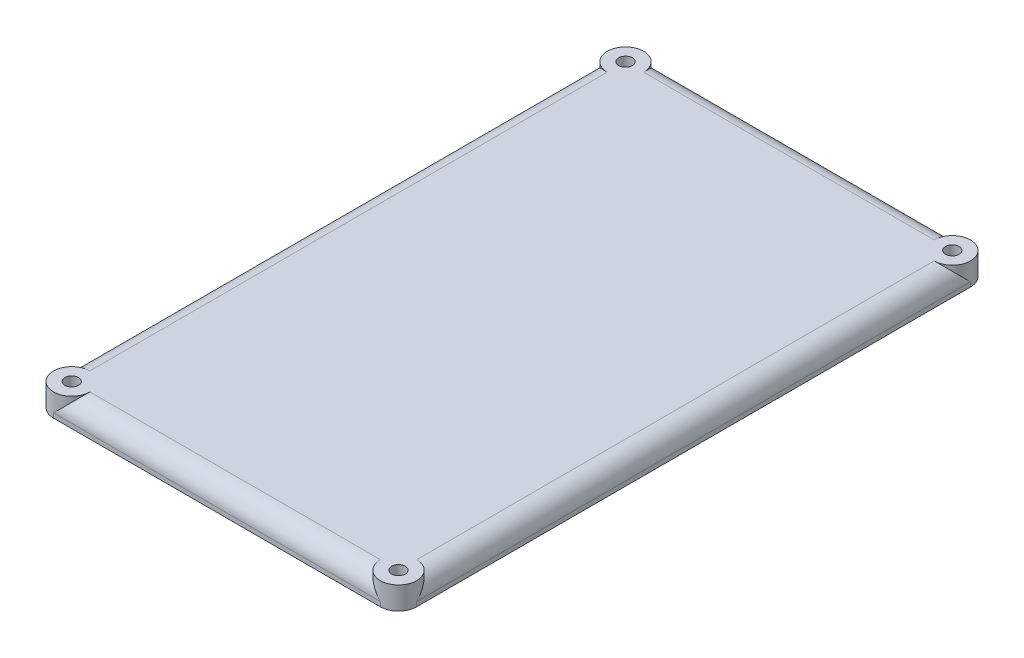
ISO-10303-21;
HEADER;
FILE_DESCRIPTION(('STEP AP214'),'2;1');
FILE_NAME('part.step','',(''),(''),'','','');
FILE_SCHEMA(('AUTOMOTIVE_DESIGN { 1 0 10303 214 1 1 1 1 }'));
ENDSEC;
DATA;
#1=APPLICATION_CONTEXT('core data for automotive mechanical design processes');
#2=APPLICATION_PROTOCOL_DEFINITION('international standard','automotive_design',2000,#1);
#3=PRODUCT_CONTEXT('',#1,'mechanical');
#4=PRODUCT('Part','Part','',(#3));
#5=PRODUCT_RELATED_PRODUCT_CATEGORY('part','',(#4));
#6=PRODUCT_DEFINITION_FORMATION('','',#4);
#7=PRODUCT_DEFINITION_CONTEXT('part definition',#1,'design');
#8=PRODUCT_DEFINITION('design','',#6,#7);
#9=PRODUCT_DEFINITION_SHAPE('','',#8);
#10=(LENGTH_UNIT() NAMED_UNIT(*) SI_UNIT(.MILLI.,.METRE.));
#11=(NAMED_UNIT(*) PLANE_ANGLE_UNIT() SI_UNIT($,.RADIAN.));
#12=(NAMED_UNIT(*) SI_UNIT($,.STERADIAN.) SOLID_ANGLE_UNIT());
#13=UNCERTAINTY_MEASURE_WITH_UNIT(LENGTH_MEASURE(1.E-05),#10,'distance_accuracy_value','');
#14=(GEOMETRIC_REPRESENTATION_CONTEXT(3) GLOBAL_UNCERTAINTY_ASSIGNED_CONTEXT((#13)) GLOBAL_UNIT_ASSIGNED_CONTEXT((#10,
#11,#12)) REPRESENTATION_CONTEXT('',''));
#15=CARTESIAN_POINT('',(0.,0.,0.));
#16=DIRECTION('',(0.,0.,1.));
#17=DIRECTION('',(1.,0.,0.));
#18=AXIS2_PLACEMENT_3D('',#15,#16,#17);
#19=CARTESIAN_POINT('',(0.,3.175,0.));
#20=DIRECTION('',(1.,0.,0.));
#21=DIRECTION('',(0.,0.,-1.));
#22=AXIS2_PLACEMENT_3D('',#19,#20,#21);
#23=PLANE('',#22);
#24=DIRECTION('',(0.,0.,1.));
#25=VECTOR('',#24,1.);
#26=CARTESIAN_POINT('',(0.,0.635,0.));
#27=LINE('',#26,#25);
#28=CARTESIAN_POINT('',(0.,0.635,80.01));
#29=VERTEX_POINT('',#28);
#30=CARTESIAN_POINT('',(0.,0.635,2.54));
#31=VERTEX_POINT('',#30);
#32=EDGE_CURVE('E188',#29,#31,#27,.F.);
#33=ORIENTED_EDGE('',*,*,#32,.T.);
#34=DIRECTION('',(0.,-1.,0.));
#35=VECTOR('',#34,1.);
#36=CARTESIAN_POINT('',(0.,3.175,2.54));
#37=LINE('',#36,#35);
#38=CARTESIAN_POINT('',(0.,0.,2.54));
#39=VERTEX_POINT('',#38);
#40=EDGE_CURVE('E192',#31,#39,#37,.T.);
#41=ORIENTED_EDGE('',*,*,#40,.T.);
#42=DIRECTION('',(0.,0.,1.));
#43=VECTOR('',#42,1.);
#44=CARTESIAN_POINT('',(0.,0.,0.));
#45=LINE('',#44,#43);
#46=CARTESIAN_POINT('',(0.,0.,80.01));
#47=VERTEX_POINT('',#46);
#48=EDGE_CURVE('E180',#39,#47,#45,.T.);
#49=ORIENTED_EDGE('',*,*,#48,.T.);
#50=DIRECTION('',(0.,-1.,0.));
#51=VECTOR('',#50,1.);
#52=CARTESIAN_POINT('',(0.,3.175,80.01));
#53=LINE('',#52,#51);
#54=EDGE_CURVE('E190',#47,#29,#53,.F.);
#55=ORIENTED_EDGE('',*,*,#54,.T.);
#56=EDGE_LOOP('',(#33,#41,#49,#55));
#57=FACE_BOUND('',#56,.T.);
#58=ADVANCED_FACE('F33',(#57),#23,.F.);
#59=CARTESIAN_POINT('',(0.,3.175,82.55));
#60=DIRECTION('',(0.,0.,-1.));
#61=DIRECTION('',(-1.,0.,0.));
#62=AXIS2_PLACEMENT_3D('',#59,#60,#61);
#63=PLANE('',#62);
#64=DIRECTION('',(1.,0.,0.));
#65=VECTOR('',#64,1.);
#66=CARTESIAN_POINT('',(0.,0.,82.55));
#67=LINE('',#66,#65);
#68=CARTESIAN_POINT('',(2.54000000000001,0.,82.55));
#69=VERTEX_POINT('',#68);
#70=CARTESIAN_POINT('',(48.26,0.,82.55));
#71=VERTEX_POINT('',#70);
#72=EDGE_CURVE('E182',#69,#71,#67,.T.);
#73=ORIENTED_EDGE('',*,*,#72,.T.);
#74=DIRECTION('',(0.,-1.,0.));
#75=VECTOR('',#74,1.);
#76=CARTESIAN_POINT('',(48.26,3.175,82.55));
#77=LINE('',#76,#75);
#78=CARTESIAN_POINT('',(48.26,0.635,82.55));
#79=VERTEX_POINT('',#78);
#80=EDGE_CURVE('E214',#71,#79,#77,.F.);
#81=ORIENTED_EDGE('',*,*,#80,.T.);
#82=DIRECTION('',(1.,0.,0.));
#83=VECTOR('',#82,1.);
#84=CARTESIAN_POINT('',(0.,0.635,82.55));
#85=LINE('',#84,#83);
#86=CARTESIAN_POINT('',(2.54000000000001,0.635,82.55));
#87=VERTEX_POINT('',#86);
#88=EDGE_CURVE('E209',#79,#87,#85,.F.);
#89=ORIENTED_EDGE('',*,*,#88,.T.);
#90=DIRECTION('',(0.,-1.,0.));
#91=VECTOR('',#90,1.);
#92=CARTESIAN_POINT('',(2.54000000000001,3.175,82.55));
#93=LINE('',#92,#91);
#94=EDGE_CURVE('E212',#87,#69,#93,.T.);
#95=ORIENTED_EDGE('',*,*,#94,.T.);
#96=EDGE_LOOP('',(#73,#81,#89,#95));
#97=FACE_BOUND('',#96,.T.);
#98=ADVANCED_FACE('F241',(#97),#63,.F.);
#99=CARTESIAN_POINT('',(50.8,3.175,0.));
#100=DIRECTION('',(-1.,0.,0.));
#101=DIRECTION('',(0.,0.,1.));
#102=AXIS2_PLACEMENT_3D('',#99,#100,#101);
#103=PLANE('',#102);
#104=DIRECTION('',(0.,0.,-1.));
#105=VECTOR('',#104,1.);
#106=CARTESIAN_POINT('',(50.8,0.,0.));
#107=LINE('',#106,#105);
#108=CARTESIAN_POINT('',(50.8,0.,80.01));
#109=VERTEX_POINT('',#108);
#110=CARTESIAN_POINT('',(50.8,0.,2.54));
#111=VERTEX_POINT('',#110);
#112=EDGE_CURVE('E184',#109,#111,#107,.T.);
#113=ORIENTED_EDGE('',*,*,#112,.T.);
#114=DIRECTION('',(0.,-1.,0.));
#115=VECTOR('',#114,1.);
#116=CARTESIAN_POINT('',(50.8,3.175,2.54));
#117=LINE('',#116,#115);
#118=CARTESIAN_POINT('',(50.8,0.635,2.54));
#119=VERTEX_POINT('',#118);
#120=EDGE_CURVE('E203',#111,#119,#117,.F.);
#121=ORIENTED_EDGE('',*,*,#120,.T.);
#122=DIRECTION('',(0.,0.,-1.));
#123=VECTOR('',#122,1.);
#124=CARTESIAN_POINT('',(50.8,0.635,82.55));
#125=LINE('',#124,#123);
#126=CARTESIAN_POINT('',(50.8,0.635,80.01));
#127=VERTEX_POINT('',#126);
#128=EDGE_CURVE('E139',#119,#127,#125,.F.);
#129=ORIENTED_EDGE('',*,*,#128,.T.);
#130=DIRECTION('',(0.,-1.,0.));
#131=VECTOR('',#130,1.);
#132=CARTESIAN_POINT('',(50.8,3.175,80.01));
#133=LINE('',#132,#131);
#134=EDGE_CURVE('E200',#127,#109,#133,.T.);
#135=ORIENTED_EDGE('',*,*,#134,.T.);
#136=EDGE_LOOP('',(#113,#121,#129,#135));
#137=FACE_BOUND('',#136,.T.);
#138=ADVANCED_FACE('F251',(#137),#103,.F.);
#139=CARTESIAN_POINT('',(0.,3.175,0.));
#140=DIRECTION('',(0.,0.,1.));
#141=DIRECTION('',(1.,0.,0.));
#142=AXIS2_PLACEMENT_3D('',#139,#140,#141);
#143=PLANE('',#142);
#144=DIRECTION('',(-1.,0.,0.));
#145=VECTOR('',#144,1.);
#146=CARTESIAN_POINT('',(0.,0.,0.));
#147=LINE('',#146,#145);
#148=CARTESIAN_POINT('',(48.26,0.,0.));
#149=VERTEX_POINT('',#148);
#150=CARTESIAN_POINT('',(2.54,0.,0.));
#151=VERTEX_POINT('',#150);
#152=EDGE_CURVE('E186',#149,#151,#147,.T.);
#153=ORIENTED_EDGE('',*,*,#152,.T.);
#154=DIRECTION('',(0.,-1.,0.));
#155=VECTOR('',#154,1.);
#156=CARTESIAN_POINT('',(2.54,3.175,0.));
#157=LINE('',#156,#155);
#158=CARTESIAN_POINT('',(2.54,0.635,0.));
#159=VERTEX_POINT('',#158);
#160=EDGE_CURVE('E198',#151,#159,#157,.F.);
#161=ORIENTED_EDGE('',*,*,#160,.T.);
#162=DIRECTION('',(-1.,0.,0.));
#163=VECTOR('',#162,1.);
#164=CARTESIAN_POINT('',(50.8,0.635,0.));
#165=LINE('',#164,#163);
#166=CARTESIAN_POINT('',(48.26,0.635,0.));
#167=VERTEX_POINT('',#166);
#168=EDGE_CURVE('E194',#159,#167,#165,.F.);
#169=ORIENTED_EDGE('',*,*,#168,.T.);
#170=DIRECTION('',(0.,-1.,0.));
#171=VECTOR('',#170,1.);
#172=CARTESIAN_POINT('',(48.26,3.175,0.));
#173=LINE('',#172,#171);
#174=EDGE_CURVE('E196',#167,#149,#173,.T.);
#175=ORIENTED_EDGE('',*,*,#174,.T.);
#176=EDGE_LOOP('',(#153,#161,#169,#175));
#177=FACE_BOUND('',#176,.T.);
#178=ADVANCED_FACE('F254',(#177),#143,.F.);
#179=CARTESIAN_POINT('',(0.,3.175,0.));
#180=DIRECTION('',(0.,1.,0.));
#181=DIRECTION('',(0.,0.,1.));
#182=AXIS2_PLACEMENT_3D('',#179,#180,#181);
#183=PLANE('',#182);
#184=CARTESIAN_POINT('',(48.26,3.175,2.54));
#185=DIRECTION('',(0.,1.,0.));
#186=DIRECTION('',(0.,0.,1.));
#187=AXIS2_PLACEMENT_3D('',#184,#185,#186);
#188=CIRCLE('',#187,0.952500000000004);
#189=CARTESIAN_POINT('',(48.26,3.175,3.4925));
#190=VERTEX_POINT('',#189);
#191=EDGE_CURVE('E321',#190,#190,#188,.T.);
#192=ORIENTED_EDGE('',*,*,#191,.F.);
#193=EDGE_LOOP('',(#192));
#194=FACE_BOUND('',#193,.T.);
#195=CARTESIAN_POINT('',(2.54000000000001,3.175,80.01));
#196=DIRECTION('',(0.,1.,0.));
#197=DIRECTION('',(0.,0.,1.));
#198=AXIS2_PLACEMENT_3D('',#195,#196,#197);
#199=CIRCLE('',#198,0.952499999999999);
#200=CARTESIAN_POINT('',(2.54000000000001,3.175,80.9625));
#201=VERTEX_POINT('',#200);
#202=EDGE_CURVE('E315',#201,#201,#199,.T.);
#203=ORIENTED_EDGE('',*,*,#202,.F.);
#204=EDGE_LOOP('',(#203));
#205=FACE_BOUND('',#204,.T.);
#206=CARTESIAN_POINT('',(48.26,3.175,80.01));
#207=DIRECTION('',(0.,1.,0.));
#208=DIRECTION('',(0.,0.,1.));
#209=AXIS2_PLACEMENT_3D('',#206,#207,#208);
#210=CIRCLE('',#209,0.952500000000002);
#211=CARTESIAN_POINT('',(48.26,3.175,80.9625));
#212=VERTEX_POINT('',#211);
#213=EDGE_CURVE('E312',#212,#212,#210,.T.);
#214=ORIENTED_EDGE('',*,*,#213,.F.);
#215=EDGE_LOOP('',(#214));
#216=FACE_BOUND('',#215,.T.);
#217=CARTESIAN_POINT('',(2.54,3.175,2.54));
#218=DIRECTION('',(0.,1.,0.));
#219=DIRECTION('',(0.,0.,1.));
#220=AXIS2_PLACEMENT_3D('',#217,#218,#219);
#221=CIRCLE('',#220,0.9525);
#222=CARTESIAN_POINT('',(2.54,3.175,3.4925));
#223=VERTEX_POINT('',#222);
#224=EDGE_CURVE('E154',#223,#223,#221,.T.);
#225=ORIENTED_EDGE('',*,*,#224,.F.);
#226=EDGE_LOOP('',(#225));
#227=FACE_BOUND('',#226,.T.);
#228=DIRECTION('',(0.,0.,-1.));
#229=VECTOR('',#228,1.);
#230=CARTESIAN_POINT('',(48.26,3.175,0.));
#231=LINE('',#230,#229);
#232=CARTESIAN_POINT('',(48.26,3.175,77.47));
#233=VERTEX_POINT('',#232);
#234=CARTESIAN_POINT('',(48.26,3.175,5.08));
#235=VERTEX_POINT('',#234);
#236=EDGE_CURVE('E123',#233,#235,#231,.T.);
#237=ORIENTED_EDGE('',*,*,#236,.T.);
#238=CARTESIAN_POINT('',(48.26,3.175,2.54));
#239=DIRECTION('',(0.,1.,0.));
#240=DIRECTION('',(0.,0.,1.));
#241=AXIS2_PLACEMENT_3D('',#238,#239,#240);
#242=CIRCLE('',#241,2.54);
#243=CARTESIAN_POINT('',(45.72,3.175,2.54));
#244=VERTEX_POINT('',#243);
#245=EDGE_CURVE('E127',#235,#244,#242,.T.);
#246=ORIENTED_EDGE('',*,*,#245,.T.);
#247=DIRECTION('',(-1.,0.,0.));
#248=VECTOR('',#247,1.);
#249=CARTESIAN_POINT('',(0.,3.175,2.54));
#250=LINE('',#249,#248);
#251=CARTESIAN_POINT('',(5.08,3.175,2.54));
#252=VERTEX_POINT('',#251);
#253=EDGE_CURVE('E132',#244,#252,#250,.T.);
#254=ORIENTED_EDGE('',*,*,#253,.T.);
#255=CARTESIAN_POINT('',(2.54,3.175,2.54));
#256=DIRECTION('',(0.,1.,0.));
#257=DIRECTION('',(0.,0.,1.));
#258=AXIS2_PLACEMENT_3D('',#255,#256,#257);
#259=CIRCLE('',#258,2.54);
#260=CARTESIAN_POINT('',(2.54,3.175,5.08));
#261=VERTEX_POINT('',#260);
#262=EDGE_CURVE('E151',#252,#261,#259,.T.);
#263=ORIENTED_EDGE('',*,*,#262,.T.);
#264=DIRECTION('',(0.,0.,1.));
#265=VECTOR('',#264,1.);
#266=CARTESIAN_POINT('',(2.54000000000001,3.175,82.55));
#267=LINE('',#266,#265);
#268=CARTESIAN_POINT('',(2.54000000000001,3.175,77.47));
#269=VERTEX_POINT('',#268);
#270=EDGE_CURVE('E133',#261,#269,#267,.T.);
#271=ORIENTED_EDGE('',*,*,#270,.T.);
#272=CARTESIAN_POINT('',(2.54000000000001,3.175,80.01));
#273=DIRECTION('',(0.,1.,0.));
#274=DIRECTION('',(0.,0.,1.));
#275=AXIS2_PLACEMENT_3D('',#272,#273,#274);
#276=CIRCLE('',#275,2.54);
#277=CARTESIAN_POINT('',(5.08000000000001,3.175,80.01));
#278=VERTEX_POINT('',#277);
#279=EDGE_CURVE('E161',#269,#278,#276,.T.);
#280=ORIENTED_EDGE('',*,*,#279,.T.);
#281=DIRECTION('',(1.,0.,0.));
#282=VECTOR('',#281,1.);
#283=CARTESIAN_POINT('',(50.8,3.175,80.01));
#284=LINE('',#283,#282);
#285=CARTESIAN_POINT('',(45.72,3.175,80.01));
#286=VERTEX_POINT('',#285);
#287=EDGE_CURVE('E205',#278,#286,#284,.T.);
#288=ORIENTED_EDGE('',*,*,#287,.T.);
#289=CARTESIAN_POINT('',(48.26,3.175,80.01));
#290=DIRECTION('',(0.,1.,0.));
#291=DIRECTION('',(0.,0.,1.));
#292=AXIS2_PLACEMENT_3D('',#289,#290,#291);
#293=CIRCLE('',#292,2.54);
#294=EDGE_CURVE('E129',#286,#233,#293,.T.);
#295=ORIENTED_EDGE('',*,*,#294,.T.);
#296=EDGE_LOOP('',(#237,#246,#254,#263,#271,#280,#288,#295));
#297=FACE_BOUND('',#296,.T.);
#298=ADVANCED_FACE('F125',(#194,#205,#216,#227,#297),#183,.T.);
#299=CARTESIAN_POINT('',(0.,0.,0.));
#300=DIRECTION('',(0.,1.,0.));
#301=DIRECTION('',(0.,0.,1.));
#302=AXIS2_PLACEMENT_3D('',#299,#300,#301);
#303=PLANE('',#302);
#304=CARTESIAN_POINT('',(48.26,0.,2.54));
#305=DIRECTION('',(0.,1.,0.));
#306=DIRECTION('',(0.,0.,1.));
#307=AXIS2_PLACEMENT_3D('',#304,#305,#306);
#308=CIRCLE('',#307,0.952500000000004);
#309=CARTESIAN_POINT('',(48.26,0.,3.4925));
#310=VERTEX_POINT('',#309);
#311=EDGE_CURVE('E318',#310,#310,#308,.T.);
#312=ORIENTED_EDGE('',*,*,#311,.T.);
#313=EDGE_LOOP('',(#312));
#314=FACE_BOUND('',#313,.T.);
#315=CARTESIAN_POINT('',(2.54000000000001,0.,80.01));
#316=DIRECTION('',(0.,1.,0.));
#317=DIRECTION('',(0.,0.,1.));
#318=AXIS2_PLACEMENT_3D('',#315,#316,#317);
#319=CIRCLE('',#318,0.952499999999999);
#320=CARTESIAN_POINT('',(2.54000000000001,0.,80.9625));
#321=VERTEX_POINT('',#320);
#322=EDGE_CURVE('E324',#321,#321,#319,.T.);
#323=ORIENTED_EDGE('',*,*,#322,.T.);
#324=EDGE_LOOP('',(#323));
#325=FACE_BOUND('',#324,.T.);
#326=CARTESIAN_POINT('',(48.26,0.,80.01));
#327=DIRECTION('',(0.,1.,0.));
#328=DIRECTION('',(0.,0.,1.));
#329=AXIS2_PLACEMENT_3D('',#326,#327,#328);
#330=CIRCLE('',#329,0.952500000000002);
#331=CARTESIAN_POINT('',(48.26,0.,80.9625));
#332=VERTEX_POINT('',#331);
#333=EDGE_CURVE('E309',#332,#332,#330,.T.);
#334=ORIENTED_EDGE('',*,*,#333,.T.);
#335=EDGE_LOOP('',(#334));
#336=FACE_BOUND('',#335,.T.);
#337=CARTESIAN_POINT('',(2.54,0.,2.54));
#338=DIRECTION('',(0.,1.,0.));
#339=DIRECTION('',(0.,0.,1.));
#340=AXIS2_PLACEMENT_3D('',#337,#338,#339);
#341=CIRCLE('',#340,0.9525);
#342=CARTESIAN_POINT('',(2.54,0.,3.4925));
#343=VERTEX_POINT('',#342);
#344=EDGE_CURVE('E148',#343,#343,#341,.T.);
#345=ORIENTED_EDGE('',*,*,#344,.T.);
#346=EDGE_LOOP('',(#345));
#347=FACE_BOUND('',#346,.T.);
#348=ORIENTED_EDGE('',*,*,#152,.F.);
#349=CARTESIAN_POINT('',(48.26,0.,2.54));
#350=DIRECTION('',(0.,1.,0.));
#351=DIRECTION('',(0.,0.,1.));
#352=AXIS2_PLACEMENT_3D('',#349,#350,#351);
#353=CIRCLE('',#352,2.54);
#354=EDGE_CURVE('E147',#111,#149,#353,.T.);
#355=ORIENTED_EDGE('',*,*,#354,.F.);
#356=ORIENTED_EDGE('',*,*,#112,.F.);
#357=CARTESIAN_POINT('',(48.26,0.,80.01));
#358=DIRECTION('',(0.,1.,0.));
#359=DIRECTION('',(0.,0.,1.));
#360=AXIS2_PLACEMENT_3D('',#357,#358,#359);
#361=CIRCLE('',#360,2.54);
#362=EDGE_CURVE('E169',#71,#109,#361,.T.);
#363=ORIENTED_EDGE('',*,*,#362,.F.);
#364=ORIENTED_EDGE('',*,*,#72,.F.);
#365=CARTESIAN_POINT('',(2.54000000000001,0.,80.01));
#366=DIRECTION('',(0.,1.,0.));
#367=DIRECTION('',(0.,0.,1.));
#368=AXIS2_PLACEMENT_3D('',#365,#366,#367);
#369=CIRCLE('',#368,2.54);
#370=EDGE_CURVE('E164',#47,#69,#369,.T.);
#371=ORIENTED_EDGE('',*,*,#370,.F.);
#372=ORIENTED_EDGE('',*,*,#48,.F.);
#373=CARTESIAN_POINT('',(2.54,0.,2.54));
#374=DIRECTION('',(0.,1.,0.));
#375=DIRECTION('',(0.,0.,1.));
#376=AXIS2_PLACEMENT_3D('',#373,#374,#375);
#377=CIRCLE('',#376,2.54);
#378=EDGE_CURVE('E158',#151,#39,#377,.T.);
#379=ORIENTED_EDGE('',*,*,#378,.F.);
#380=EDGE_LOOP('',(#348,#355,#356,#363,#364,#371,#372,#379));
#381=FACE_BOUND('',#380,.T.);
#382=ADVANCED_FACE('F235',(#314,#325,#336,#347,#381),#303,.F.);
#383=CARTESIAN_POINT('',(48.26,0.635,0.));
#384=DIRECTION('',(0.,0.,1.));
#385=DIRECTION('',(1.,0.,0.));
#386=AXIS2_PLACEMENT_3D('',#383,#384,#385);
#387=CYLINDRICAL_SURFACE('',#386,2.54);
#388=CARTESIAN_POINT('',(48.26,0.635,2.54));
#389=DIRECTION('',(0.,-0.707106781186547,0.707106781186547));
#390=DIRECTION('',(0.,0.707106781186547,0.707106781186547));
#391=AXIS2_PLACEMENT_3D('',#388,#389,#390);
#392=ELLIPSE('',#391,3.59210244842766,2.54);
#393=EDGE_CURVE('E137',#235,#119,#392,.F.);
#394=ORIENTED_EDGE('',*,*,#393,.F.);
#395=ORIENTED_EDGE('',*,*,#236,.F.);
#396=CARTESIAN_POINT('',(48.26,0.635,80.01));
#397=DIRECTION('',(0.,0.707106781186547,0.707106781186547));
#398=DIRECTION('',(0.,-0.707106781186547,0.707106781186547));
#399=AXIS2_PLACEMENT_3D('',#396,#397,#398);
#400=ELLIPSE('',#399,3.59210244842766,2.54);
#401=EDGE_CURVE('E142',#127,#233,#400,.T.);
#402=ORIENTED_EDGE('',*,*,#401,.F.);
#403=ORIENTED_EDGE('',*,*,#128,.F.);
#404=EDGE_LOOP('',(#394,#395,#402,#403));
#405=FACE_BOUND('',#404,.T.);
#406=ADVANCED_FACE('F35',(#405),#387,.T.);
#407=CARTESIAN_POINT('',(0.,0.635,80.01));
#408=DIRECTION('',(-1.,0.,0.));
#409=DIRECTION('',(0.,0.,1.));
#410=AXIS2_PLACEMENT_3D('',#407,#408,#409);
#411=CYLINDRICAL_SURFACE('',#410,2.54);
#412=CARTESIAN_POINT('',(2.54000000000001,0.635,80.01));
#413=DIRECTION('',(-0.707106781186547,0.707106781186547,0.));
#414=DIRECTION('',(-0.707106781186547,-0.707106781186547,0.));
#415=AXIS2_PLACEMENT_3D('',#412,#413,#414);
#416=ELLIPSE('',#415,3.59210244842766,2.54);
#417=EDGE_CURVE('E143',#87,#278,#416,.T.);
#418=ORIENTED_EDGE('',*,*,#417,.F.);
#419=ORIENTED_EDGE('',*,*,#88,.F.);
#420=CARTESIAN_POINT('',(48.26,0.635,80.01));
#421=DIRECTION('',(-0.707106781186547,-0.707106781186547,0.));
#422=DIRECTION('',(-0.707106781186547,0.707106781186547,0.));
#423=AXIS2_PLACEMENT_3D('',#420,#421,#422);
#424=ELLIPSE('',#423,3.59210244842766,2.54);
#425=EDGE_CURVE('E11',#286,#79,#424,.F.);
#426=ORIENTED_EDGE('',*,*,#425,.F.);
#427=ORIENTED_EDGE('',*,*,#287,.F.);
#428=EDGE_LOOP('',(#418,#419,#426,#427));
#429=FACE_BOUND('',#428,.T.);
#430=ADVANCED_FACE('F246',(#429),#411,.T.);
#431=CARTESIAN_POINT('',(0.,0.635,2.54));
#432=DIRECTION('',(1.,0.,0.));
#433=DIRECTION('',(0.,0.,-1.));
#434=AXIS2_PLACEMENT_3D('',#431,#432,#433);
#435=CYLINDRICAL_SURFACE('',#434,2.54);
#436=CARTESIAN_POINT('',(48.26,0.635,2.54));
#437=DIRECTION('',(0.707106781186547,0.707106781186547,0.));
#438=DIRECTION('',(0.707106781186547,-0.707106781186547,0.));
#439=AXIS2_PLACEMENT_3D('',#436,#437,#438);
#440=ELLIPSE('',#439,3.59210244842766,2.54);
#441=EDGE_CURVE('E41',#167,#244,#440,.T.);
#442=ORIENTED_EDGE('',*,*,#441,.F.);
#443=ORIENTED_EDGE('',*,*,#168,.F.);
#444=CARTESIAN_POINT('',(2.54,0.635,2.54));
#445=DIRECTION('',(0.707106781186547,-0.707106781186547,0.));
#446=DIRECTION('',(0.707106781186547,0.707106781186547,0.));
#447=AXIS2_PLACEMENT_3D('',#444,#445,#446);
#448=ELLIPSE('',#447,3.59210244842766,2.54);
#449=EDGE_CURVE('E174',#252,#159,#448,.F.);
#450=ORIENTED_EDGE('',*,*,#449,.F.);
#451=ORIENTED_EDGE('',*,*,#253,.F.);
#452=EDGE_LOOP('',(#442,#443,#450,#451));
#453=FACE_BOUND('',#452,.T.);
#454=ADVANCED_FACE('F256',(#453),#435,.T.);
#455=CARTESIAN_POINT('',(2.54,0.635,0.));
#456=DIRECTION('',(0.,0.,-1.));
#457=DIRECTION('',(-1.,0.,0.));
#458=AXIS2_PLACEMENT_3D('',#455,#456,#457);
#459=CYLINDRICAL_SURFACE('',#458,2.54);
#460=CARTESIAN_POINT('',(2.54,0.635,2.54));
#461=DIRECTION('',(0.,0.707106781186547,-0.707106781186547));
#462=DIRECTION('',(0.,-0.707106781186547,-0.707106781186547));
#463=AXIS2_PLACEMENT_3D('',#460,#461,#462);
#464=ELLIPSE('',#463,3.59210244842766,2.54);
#465=EDGE_CURVE('E55',#31,#261,#464,.T.);
#466=ORIENTED_EDGE('',*,*,#465,.F.);
#467=ORIENTED_EDGE('',*,*,#32,.F.);
#468=CARTESIAN_POINT('',(2.54000000000001,0.635,80.01));
#469=DIRECTION('',(0.,-0.707106781186547,-0.707106781186547));
#470=DIRECTION('',(0.,0.707106781186547,-0.707106781186547));
#471=AXIS2_PLACEMENT_3D('',#468,#469,#470);
#472=ELLIPSE('',#471,3.59210244842766,2.54);
#473=EDGE_CURVE('E216',#269,#29,#472,.F.);
#474=ORIENTED_EDGE('',*,*,#473,.F.);
#475=ORIENTED_EDGE('',*,*,#270,.F.);
#476=EDGE_LOOP('',(#466,#467,#474,#475));
#477=FACE_BOUND('',#476,.T.);
#478=ADVANCED_FACE('F224',(#477),#459,.T.);
#479=CARTESIAN_POINT('',(48.26,0.,80.01));
#480=DIRECTION('',(0.,1.,0.));
#481=DIRECTION('',(0.,0.,1.));
#482=AXIS2_PLACEMENT_3D('',#479,#480,#481);
#483=CYLINDRICAL_SURFACE('',#482,2.54);
#484=ORIENTED_EDGE('',*,*,#362,.T.);
#485=ORIENTED_EDGE('',*,*,#134,.F.);
#486=ORIENTED_EDGE('',*,*,#401,.T.);
#487=ORIENTED_EDGE('',*,*,#294,.F.);
#488=ORIENTED_EDGE('',*,*,#425,.T.);
#489=ORIENTED_EDGE('',*,*,#80,.F.);
#490=EDGE_LOOP('',(#484,#485,#486,#487,#488,#489));
#491=FACE_BOUND('',#490,.T.);
#492=ADVANCED_FACE('F248',(#491),#483,.T.);
#493=CARTESIAN_POINT('',(2.54000000000001,0.,80.01));
#494=DIRECTION('',(0.,1.,0.));
#495=DIRECTION('',(0.,0.,1.));
#496=AXIS2_PLACEMENT_3D('',#493,#494,#495);
#497=CYLINDRICAL_SURFACE('',#496,2.54);
#498=ORIENTED_EDGE('',*,*,#370,.T.);
#499=ORIENTED_EDGE('',*,*,#94,.F.);
#500=ORIENTED_EDGE('',*,*,#417,.T.);
#501=ORIENTED_EDGE('',*,*,#279,.F.);
#502=ORIENTED_EDGE('',*,*,#473,.T.);
#503=ORIENTED_EDGE('',*,*,#54,.F.);
#504=EDGE_LOOP('',(#498,#499,#500,#501,#502,#503));
#505=FACE_BOUND('',#504,.T.);
#506=ADVANCED_FACE('F222',(#505),#497,.T.);
#507=CARTESIAN_POINT('',(2.54,0.,2.54));
#508=DIRECTION('',(0.,1.,0.));
#509=DIRECTION('',(0.,0.,1.));
#510=AXIS2_PLACEMENT_3D('',#507,#508,#509);
#511=CYLINDRICAL_SURFACE('',#510,2.54);
#512=ORIENTED_EDGE('',*,*,#160,.F.);
#513=ORIENTED_EDGE('',*,*,#378,.T.);
#514=ORIENTED_EDGE('',*,*,#40,.F.);
#515=ORIENTED_EDGE('',*,*,#465,.T.);
#516=ORIENTED_EDGE('',*,*,#262,.F.);
#517=ORIENTED_EDGE('',*,*,#449,.T.);
#518=EDGE_LOOP('',(#512,#513,#514,#515,#516,#517));
#519=FACE_BOUND('',#518,.T.);
#520=ADVANCED_FACE('F230',(#519),#511,.T.);
#521=CARTESIAN_POINT('',(48.26,0.,2.54));
#522=DIRECTION('',(0.,1.,0.));
#523=DIRECTION('',(0.,0.,1.));
#524=AXIS2_PLACEMENT_3D('',#521,#522,#523);
#525=CYLINDRICAL_SURFACE('',#524,2.54);
#526=ORIENTED_EDGE('',*,*,#120,.F.);
#527=ORIENTED_EDGE('',*,*,#354,.T.);
#528=ORIENTED_EDGE('',*,*,#174,.F.);
#529=ORIENTED_EDGE('',*,*,#441,.T.);
#530=ORIENTED_EDGE('',*,*,#245,.F.);
#531=ORIENTED_EDGE('',*,*,#393,.T.);
#532=EDGE_LOOP('',(#526,#527,#528,#529,#530,#531));
#533=FACE_BOUND('',#532,.T.);
#534=ADVANCED_FACE('F145',(#533),#525,.T.);
#535=CARTESIAN_POINT('',(2.54,0.,2.54));
#536=DIRECTION('',(0.,1.,0.));
#537=DIRECTION('',(0.,0.,1.));
#538=AXIS2_PLACEMENT_3D('',#535,#536,#537);
#539=CYLINDRICAL_SURFACE('',#538,0.9525);
#540=ORIENTED_EDGE('',*,*,#344,.F.);
#541=EDGE_LOOP('',(#540));
#542=FACE_BOUND('',#541,.T.);
#543=ORIENTED_EDGE('',*,*,#224,.T.);
#544=EDGE_LOOP('',(#543));
#545=FACE_BOUND('',#544,.T.);
#546=ADVANCED_FACE('F289',(#542,#545),#539,.F.);
#547=CARTESIAN_POINT('',(48.26,0.,80.01));
#548=DIRECTION('',(0.,1.,0.));
#549=DIRECTION('',(0.,0.,1.));
#550=AXIS2_PLACEMENT_3D('',#547,#548,#549);
#551=CYLINDRICAL_SURFACE('',#550,0.952500000000002);
#552=ORIENTED_EDGE('',*,*,#333,.F.);
#553=EDGE_LOOP('',(#552));
#554=FACE_BOUND('',#553,.T.);
#555=ORIENTED_EDGE('',*,*,#213,.T.);
#556=EDGE_LOOP('',(#555));
#557=FACE_BOUND('',#556,.T.);
#558=ADVANCED_FACE('F292',(#554,#557),#551,.F.);
#559=CARTESIAN_POINT('',(2.54000000000001,0.,80.01));
#560=DIRECTION('',(0.,1.,0.));
#561=DIRECTION('',(0.,0.,1.));
#562=AXIS2_PLACEMENT_3D('',#559,#560,#561);
#563=CYLINDRICAL_SURFACE('',#562,0.952499999999999);
#564=ORIENTED_EDGE('',*,*,#322,.F.);
#565=EDGE_LOOP('',(#564));
#566=FACE_BOUND('',#565,.T.);
#567=ORIENTED_EDGE('',*,*,#202,.T.);
#568=EDGE_LOOP('',(#567));
#569=FACE_BOUND('',#568,.T.);
#570=ADVANCED_FACE('F294',(#566,#569),#563,.F.);
#571=CARTESIAN_POINT('',(48.26,0.,2.54));
#572=DIRECTION('',(0.,1.,0.));
#573=DIRECTION('',(0.,0.,1.));
#574=AXIS2_PLACEMENT_3D('',#571,#572,#573);
#575=CYLINDRICAL_SURFACE('',#574,0.952500000000004);
#576=ORIENTED_EDGE('',*,*,#311,.F.);
#577=EDGE_LOOP('',(#576));
#578=FACE_BOUND('',#577,.T.);
#579=ORIENTED_EDGE('',*,*,#191,.T.);
#580=EDGE_LOOP('',(#579));
#581=FACE_BOUND('',#580,.T.);
#582=ADVANCED_FACE('F297',(#578,#581),#575,.F.);
#583=CLOSED_SHELL('',(#58,#98,#138,#178,#298,#382,#406,#430,#454,#478,#492,#506,#520,#534,#546,
#558,#570,#582));
#584=MANIFOLD_SOLID_BREP('B2',#583);
#585=ADVANCED_BREP_SHAPE_REPRESENTATION('',(#18,#584),#14);
#586=SHAPE_DEFINITION_REPRESENTATION(#9,#585);
ENDSEC;
END-ISO-10303-21;
